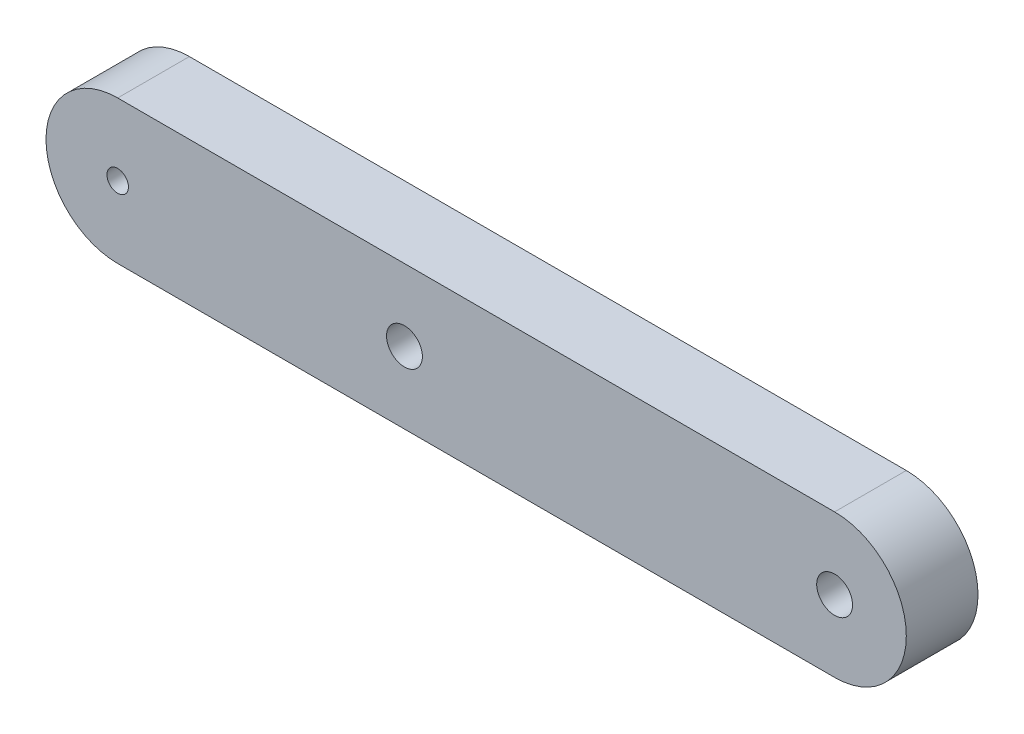
ISO-10303-21;
HEADER;
FILE_DESCRIPTION(('STEP AP214'),'2;1');
FILE_NAME('part.step','',(''),(''),'','','');
FILE_SCHEMA(('AUTOMOTIVE_DESIGN { 1 0 10303 214 1 1 1 1 }'));
ENDSEC;
DATA;
#1=APPLICATION_CONTEXT('core data for automotive mechanical design processes');
#2=APPLICATION_PROTOCOL_DEFINITION('international standard','automotive_design',2000,#1);
#3=PRODUCT_CONTEXT('',#1,'mechanical');
#4=PRODUCT('Part','Part','',(#3));
#5=PRODUCT_RELATED_PRODUCT_CATEGORY('part','',(#4));
#6=PRODUCT_DEFINITION_FORMATION('','',#4);
#7=PRODUCT_DEFINITION_CONTEXT('part definition',#1,'design');
#8=PRODUCT_DEFINITION('design','',#6,#7);
#9=PRODUCT_DEFINITION_SHAPE('','',#8);
#10=(LENGTH_UNIT() NAMED_UNIT(*) SI_UNIT(.MILLI.,.METRE.));
#11=(NAMED_UNIT(*) PLANE_ANGLE_UNIT() SI_UNIT($,.RADIAN.));
#12=(NAMED_UNIT(*) SI_UNIT($,.STERADIAN.) SOLID_ANGLE_UNIT());
#13=UNCERTAINTY_MEASURE_WITH_UNIT(LENGTH_MEASURE(1.E-05),#10,'distance_accuracy_value','');
#14=(GEOMETRIC_REPRESENTATION_CONTEXT(3) GLOBAL_UNCERTAINTY_ASSIGNED_CONTEXT((#13)) GLOBAL_UNIT_ASSIGNED_CONTEXT((#10,
#11,#12)) REPRESENTATION_CONTEXT('',''));
#15=CARTESIAN_POINT('',(0.,0.,0.));
#16=DIRECTION('',(0.,0.,1.));
#17=DIRECTION('',(1.,0.,0.));
#18=AXIS2_PLACEMENT_3D('',#15,#16,#17);
#19=CARTESIAN_POINT('',(60.,10.,-10.));
#20=DIRECTION('',(0.,0.,1.));
#21=DIRECTION('',(-1.,0.,0.));
#22=AXIS2_PLACEMENT_3D('',#19,#20,#21);
#23=PLANE('',#22);
#24=CARTESIAN_POINT('',(60.,10.,-10.));
#25=DIRECTION('',(0.,0.,1.));
#26=DIRECTION('',(-1.,0.,0.));
#27=AXIS2_PLACEMENT_3D('',#24,#25,#26);
#28=CIRCLE('',#27,10.);
#29=CARTESIAN_POINT('',(60.,0.,-10.));
#30=VERTEX_POINT('',#29);
#31=CARTESIAN_POINT('',(60.,20.,-10.));
#32=VERTEX_POINT('',#31);
#33=EDGE_CURVE('E91',#30,#32,#28,.T.);
#34=ORIENTED_EDGE('',*,*,#33,.F.);
#35=DIRECTION('',(1.,0.,0.));
#36=VECTOR('',#35,1.);
#37=CARTESIAN_POINT('',(-40.,0.,-10.));
#38=LINE('',#37,#36);
#39=CARTESIAN_POINT('',(-40.,0.,-10.));
#40=VERTEX_POINT('',#39);
#41=EDGE_CURVE('E94',#40,#30,#38,.T.);
#42=ORIENTED_EDGE('',*,*,#41,.F.);
#43=CARTESIAN_POINT('',(-40.,10.,-10.));
#44=DIRECTION('',(0.,0.,1.));
#45=DIRECTION('',(1.,0.,0.));
#46=AXIS2_PLACEMENT_3D('',#43,#44,#45);
#47=CIRCLE('',#46,10.);
#48=CARTESIAN_POINT('',(-40.,20.,-10.));
#49=VERTEX_POINT('',#48);
#50=EDGE_CURVE('E82',#49,#40,#47,.T.);
#51=ORIENTED_EDGE('',*,*,#50,.F.);
#52=DIRECTION('',(-1.,0.,0.));
#53=VECTOR('',#52,1.);
#54=CARTESIAN_POINT('',(-40.,20.,-10.));
#55=LINE('',#54,#53);
#56=EDGE_CURVE('E87',#32,#49,#55,.T.);
#57=ORIENTED_EDGE('',*,*,#56,.F.);
#58=EDGE_LOOP('',(#34,#42,#51,#57));
#59=FACE_BOUND('',#58,.T.);
#60=CARTESIAN_POINT('',(0.,10.,-10.));
#61=DIRECTION('',(0.,0.,1.));
#62=DIRECTION('',(1.,0.,0.));
#63=AXIS2_PLACEMENT_3D('',#60,#61,#62);
#64=CIRCLE('',#63,2.5);
#65=CARTESIAN_POINT('',(2.5,10.,-10.));
#66=VERTEX_POINT('',#65);
#67=EDGE_CURVE('E103',#66,#66,#64,.T.);
#68=ORIENTED_EDGE('',*,*,#67,.T.);
#69=EDGE_LOOP('',(#68));
#70=FACE_BOUND('',#69,.T.);
#71=CARTESIAN_POINT('',(60.,10.,-10.));
#72=DIRECTION('',(0.,0.,1.));
#73=DIRECTION('',(1.,0.,0.));
#74=AXIS2_PLACEMENT_3D('',#71,#72,#73);
#75=CIRCLE('',#74,2.5);
#76=CARTESIAN_POINT('',(62.5,10.,-10.));
#77=VERTEX_POINT('',#76);
#78=EDGE_CURVE('E114',#77,#77,#75,.T.);
#79=ORIENTED_EDGE('',*,*,#78,.T.);
#80=EDGE_LOOP('',(#79));
#81=FACE_BOUND('',#80,.T.);
#82=CARTESIAN_POINT('',(-40.,9.98358211799638,-10.));
#83=DIRECTION('',(0.,0.,1.));
#84=DIRECTION('',(1.,0.,0.));
#85=AXIS2_PLACEMENT_3D('',#82,#83,#84);
#86=CIRCLE('',#85,1.5);
#87=CARTESIAN_POINT('',(-38.5,9.98358211799638,-10.));
#88=VERTEX_POINT('',#87);
#89=EDGE_CURVE('E120',#88,#88,#86,.T.);
#90=ORIENTED_EDGE('',*,*,#89,.T.);
#91=EDGE_LOOP('',(#90));
#92=FACE_BOUND('',#91,.T.);
#93=ADVANCED_FACE('F35',(#59,#70,#81,#92),#23,.F.);
#94=CARTESIAN_POINT('',(60.,10.,0.));
#95=DIRECTION('',(0.,0.,1.));
#96=DIRECTION('',(-1.,0.,0.));
#97=AXIS2_PLACEMENT_3D('',#94,#95,#96);
#98=PLANE('',#97);
#99=CARTESIAN_POINT('',(60.,10.,0.));
#100=DIRECTION('',(0.,0.,1.));
#101=DIRECTION('',(1.,0.,0.));
#102=AXIS2_PLACEMENT_3D('',#99,#100,#101);
#103=CIRCLE('',#102,2.5);
#104=CARTESIAN_POINT('',(62.5,10.,0.));
#105=VERTEX_POINT('',#104);
#106=EDGE_CURVE('E117',#105,#105,#103,.T.);
#107=ORIENTED_EDGE('',*,*,#106,.F.);
#108=EDGE_LOOP('',(#107));
#109=FACE_BOUND('',#108,.T.);
#110=CARTESIAN_POINT('',(60.,10.,0.));
#111=DIRECTION('',(0.,0.,1.));
#112=DIRECTION('',(-1.,0.,0.));
#113=AXIS2_PLACEMENT_3D('',#110,#111,#112);
#114=CIRCLE('',#113,10.);
#115=CARTESIAN_POINT('',(60.,0.,0.));
#116=VERTEX_POINT('',#115);
#117=CARTESIAN_POINT('',(60.,20.,0.));
#118=VERTEX_POINT('',#117);
#119=EDGE_CURVE('E99',#116,#118,#114,.T.);
#120=ORIENTED_EDGE('',*,*,#119,.T.);
#121=DIRECTION('',(-1.,0.,0.));
#122=VECTOR('',#121,1.);
#123=CARTESIAN_POINT('',(-40.,20.,0.));
#124=LINE('',#123,#122);
#125=CARTESIAN_POINT('',(-40.,20.,0.));
#126=VERTEX_POINT('',#125);
#127=EDGE_CURVE('E102',#118,#126,#124,.T.);
#128=ORIENTED_EDGE('',*,*,#127,.T.);
#129=CARTESIAN_POINT('',(-40.,10.,0.));
#130=DIRECTION('',(0.,0.,1.));
#131=DIRECTION('',(1.,0.,0.));
#132=AXIS2_PLACEMENT_3D('',#129,#130,#131);
#133=CIRCLE('',#132,10.);
#134=CARTESIAN_POINT('',(-40.,0.,0.));
#135=VERTEX_POINT('',#134);
#136=EDGE_CURVE('E85',#126,#135,#133,.T.);
#137=ORIENTED_EDGE('',*,*,#136,.T.);
#138=DIRECTION('',(1.,0.,0.));
#139=VECTOR('',#138,1.);
#140=CARTESIAN_POINT('',(-40.,0.,0.));
#141=LINE('',#140,#139);
#142=EDGE_CURVE('E106',#135,#116,#141,.T.);
#143=ORIENTED_EDGE('',*,*,#142,.T.);
#144=EDGE_LOOP('',(#120,#128,#137,#143));
#145=FACE_BOUND('',#144,.T.);
#146=CARTESIAN_POINT('',(0.,10.,0.));
#147=DIRECTION('',(0.,0.,1.));
#148=DIRECTION('',(1.,0.,0.));
#149=AXIS2_PLACEMENT_3D('',#146,#147,#148);
#150=CIRCLE('',#149,2.5);
#151=CARTESIAN_POINT('',(2.5,10.,0.));
#152=VERTEX_POINT('',#151);
#153=EDGE_CURVE('E111',#152,#152,#150,.T.);
#154=ORIENTED_EDGE('',*,*,#153,.F.);
#155=EDGE_LOOP('',(#154));
#156=FACE_BOUND('',#155,.T.);
#157=CARTESIAN_POINT('',(-40.,9.98358211799638,0.));
#158=DIRECTION('',(0.,0.,1.));
#159=DIRECTION('',(1.,0.,0.));
#160=AXIS2_PLACEMENT_3D('',#157,#158,#159);
#161=CIRCLE('',#160,1.5);
#162=CARTESIAN_POINT('',(-38.5,9.98358211799638,0.));
#163=VERTEX_POINT('',#162);
#164=EDGE_CURVE('E123',#163,#163,#161,.T.);
#165=ORIENTED_EDGE('',*,*,#164,.F.);
#166=EDGE_LOOP('',(#165));
#167=FACE_BOUND('',#166,.T.);
#168=ADVANCED_FACE('F137',(#109,#145,#156,#167),#98,.T.);
#169=CARTESIAN_POINT('',(60.,10.,-10.));
#170=DIRECTION('',(0.,0.,1.));
#171=DIRECTION('',(-1.,0.,0.));
#172=AXIS2_PLACEMENT_3D('',#169,#170,#171);
#173=CYLINDRICAL_SURFACE('',#172,10.);
#174=ORIENTED_EDGE('',*,*,#119,.F.);
#175=DIRECTION('',(0.,0.,1.));
#176=VECTOR('',#175,1.);
#177=CARTESIAN_POINT('',(60.,0.,-10.));
#178=LINE('',#177,#176);
#179=EDGE_CURVE('E52',#30,#116,#178,.T.);
#180=ORIENTED_EDGE('',*,*,#179,.F.);
#181=ORIENTED_EDGE('',*,*,#33,.T.);
#182=DIRECTION('',(0.,0.,1.));
#183=VECTOR('',#182,1.);
#184=CARTESIAN_POINT('',(60.,20.,-10.));
#185=LINE('',#184,#183);
#186=EDGE_CURVE('E11',#32,#118,#185,.T.);
#187=ORIENTED_EDGE('',*,*,#186,.T.);
#188=EDGE_LOOP('',(#174,#180,#181,#187));
#189=FACE_BOUND('',#188,.T.);
#190=ADVANCED_FACE('F37',(#189),#173,.T.);
#191=CARTESIAN_POINT('',(-40.,20.,-10.));
#192=DIRECTION('',(0.,-1.,0.));
#193=DIRECTION('',(0.,0.,1.));
#194=AXIS2_PLACEMENT_3D('',#191,#192,#193);
#195=PLANE('',#194);
#196=ORIENTED_EDGE('',*,*,#127,.F.);
#197=ORIENTED_EDGE('',*,*,#186,.F.);
#198=ORIENTED_EDGE('',*,*,#56,.T.);
#199=DIRECTION('',(0.,0.,1.));
#200=VECTOR('',#199,1.);
#201=CARTESIAN_POINT('',(-40.,20.,-10.));
#202=LINE('',#201,#200);
#203=EDGE_CURVE('E44',#49,#126,#202,.T.);
#204=ORIENTED_EDGE('',*,*,#203,.T.);
#205=EDGE_LOOP('',(#196,#197,#198,#204));
#206=FACE_BOUND('',#205,.T.);
#207=ADVANCED_FACE('F88',(#206),#195,.F.);
#208=CARTESIAN_POINT('',(-40.,10.,-10.));
#209=DIRECTION('',(0.,0.,1.));
#210=DIRECTION('',(-1.,0.,0.));
#211=AXIS2_PLACEMENT_3D('',#208,#209,#210);
#212=CYLINDRICAL_SURFACE('',#211,10.);
#213=ORIENTED_EDGE('',*,*,#136,.F.);
#214=ORIENTED_EDGE('',*,*,#203,.F.);
#215=ORIENTED_EDGE('',*,*,#50,.T.);
#216=DIRECTION('',(0.,0.,1.));
#217=VECTOR('',#216,1.);
#218=CARTESIAN_POINT('',(-40.,0.,-10.));
#219=LINE('',#218,#217);
#220=EDGE_CURVE('E68',#40,#135,#219,.T.);
#221=ORIENTED_EDGE('',*,*,#220,.T.);
#222=EDGE_LOOP('',(#213,#214,#215,#221));
#223=FACE_BOUND('',#222,.T.);
#224=ADVANCED_FACE('F80',(#223),#212,.T.);
#225=CARTESIAN_POINT('',(-40.,0.,-10.));
#226=DIRECTION('',(0.,1.,0.));
#227=DIRECTION('',(-1.,0.,0.));
#228=AXIS2_PLACEMENT_3D('',#225,#226,#227);
#229=PLANE('',#228);
#230=ORIENTED_EDGE('',*,*,#142,.F.);
#231=ORIENTED_EDGE('',*,*,#220,.F.);
#232=ORIENTED_EDGE('',*,*,#41,.T.);
#233=ORIENTED_EDGE('',*,*,#179,.T.);
#234=EDGE_LOOP('',(#230,#231,#232,#233));
#235=FACE_BOUND('',#234,.T.);
#236=ADVANCED_FACE('F149',(#235),#229,.F.);
#237=CARTESIAN_POINT('',(0.,10.,-10.));
#238=DIRECTION('',(0.,0.,1.));
#239=DIRECTION('',(-1.,0.,0.));
#240=AXIS2_PLACEMENT_3D('',#237,#238,#239);
#241=CYLINDRICAL_SURFACE('',#240,2.5);
#242=ORIENTED_EDGE('',*,*,#67,.F.);
#243=EDGE_LOOP('',(#242));
#244=FACE_BOUND('',#243,.T.);
#245=ORIENTED_EDGE('',*,*,#153,.T.);
#246=EDGE_LOOP('',(#245));
#247=FACE_BOUND('',#246,.T.);
#248=ADVANCED_FACE('F152',(#244,#247),#241,.F.);
#249=CARTESIAN_POINT('',(60.,10.,-10.));
#250=DIRECTION('',(0.,0.,1.));
#251=DIRECTION('',(-1.,0.,0.));
#252=AXIS2_PLACEMENT_3D('',#249,#250,#251);
#253=CYLINDRICAL_SURFACE('',#252,2.5);
#254=ORIENTED_EDGE('',*,*,#78,.F.);
#255=EDGE_LOOP('',(#254));
#256=FACE_BOUND('',#255,.T.);
#257=ORIENTED_EDGE('',*,*,#106,.T.);
#258=EDGE_LOOP('',(#257));
#259=FACE_BOUND('',#258,.T.);
#260=ADVANCED_FACE('F133',(#256,#259),#253,.F.);
#261=CARTESIAN_POINT('',(-40.,9.98358211799638,-10.));
#262=DIRECTION('',(0.,0.,1.));
#263=DIRECTION('',(-1.,0.,0.));
#264=AXIS2_PLACEMENT_3D('',#261,#262,#263);
#265=CYLINDRICAL_SURFACE('',#264,1.5);
#266=ORIENTED_EDGE('',*,*,#89,.F.);
#267=EDGE_LOOP('',(#266));
#268=FACE_BOUND('',#267,.T.);
#269=ORIENTED_EDGE('',*,*,#164,.T.);
#270=EDGE_LOOP('',(#269));
#271=FACE_BOUND('',#270,.T.);
#272=ADVANCED_FACE('F130',(#268,#271),#265,.F.);
#273=CLOSED_SHELL('',(#93,#168,#190,#207,#224,#236,#248,#260,#272));
#274=MANIFOLD_SOLID_BREP('B2',#273);
#275=ADVANCED_BREP_SHAPE_REPRESENTATION('',(#18,#274),#14);
#276=SHAPE_DEFINITION_REPRESENTATION(#9,#275);
ENDSEC;
END-ISO-10303-21;
